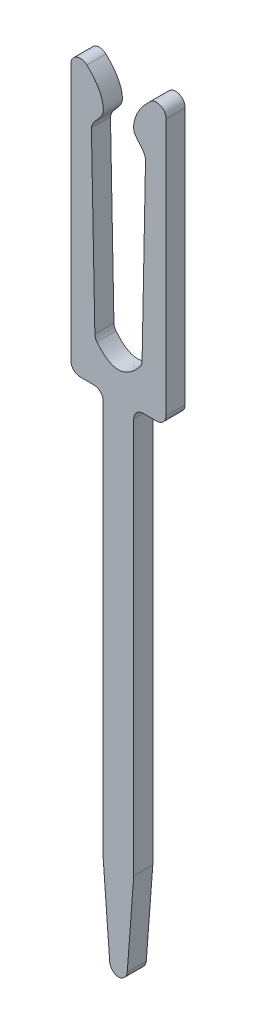
ISO-10303-21;
HEADER;
FILE_DESCRIPTION(('STEP AP214'),'2;1');
FILE_NAME('part.step','',(''),(''),'','','');
FILE_SCHEMA(('AUTOMOTIVE_DESIGN { 1 0 10303 214 1 1 1 1 }'));
ENDSEC;
DATA;
#1=APPLICATION_CONTEXT('core data for automotive mechanical design processes');
#2=APPLICATION_PROTOCOL_DEFINITION('international standard','automotive_design',2000,#1);
#3=PRODUCT_CONTEXT('',#1,'mechanical');
#4=PRODUCT('Part','Part','',(#3));
#5=PRODUCT_RELATED_PRODUCT_CATEGORY('part','',(#4));
#6=PRODUCT_DEFINITION_FORMATION('','',#4);
#7=PRODUCT_DEFINITION_CONTEXT('part definition',#1,'design');
#8=PRODUCT_DEFINITION('design','',#6,#7);
#9=PRODUCT_DEFINITION_SHAPE('','',#8);
#10=(LENGTH_UNIT() NAMED_UNIT(*) SI_UNIT(.MILLI.,.METRE.));
#11=(NAMED_UNIT(*) PLANE_ANGLE_UNIT() SI_UNIT($,.RADIAN.));
#12=(NAMED_UNIT(*) SI_UNIT($,.STERADIAN.) SOLID_ANGLE_UNIT());
#13=UNCERTAINTY_MEASURE_WITH_UNIT(LENGTH_MEASURE(1.E-05),#10,'distance_accuracy_value','');
#14=(GEOMETRIC_REPRESENTATION_CONTEXT(3) GLOBAL_UNCERTAINTY_ASSIGNED_CONTEXT((#13)) GLOBAL_UNIT_ASSIGNED_CONTEXT((#10,
#11,#12)) REPRESENTATION_CONTEXT('',''));
#15=CARTESIAN_POINT('',(0.,0.,0.));
#16=DIRECTION('',(0.,0.,1.));
#17=DIRECTION('',(1.,0.,0.));
#18=AXIS2_PLACEMENT_3D('',#15,#16,#17);
#19=CARTESIAN_POINT('',(0.0155617112013381,0.199393663752104,-0.2));
#20=DIRECTION('',(0.,0.,1.));
#21=DIRECTION('',(1.,0.,0.));
#22=AXIS2_PLACEMENT_3D('',#19,#20,#21);
#23=CYLINDRICAL_SURFACE('',#22,0.200000000000002);
#24=CARTESIAN_POINT('',(0.0155617112013381,0.199393663752104,0.2));
#25=DIRECTION('',(0.,0.,1.));
#26=DIRECTION('',(-1.,0.,0.));
#27=AXIS2_PLACEMENT_3D('',#24,#25,#26);
#28=CIRCLE('',#27,0.200000000000002);
#29=CARTESIAN_POINT('',(-0.183878150776376,0.184435674104075,0.2));
#30=VERTEX_POINT('',#29);
#31=CARTESIAN_POINT('',(0.,0.,0.2));
#32=VERTEX_POINT('',#31);
#33=EDGE_CURVE('E221',#30,#32,#28,.T.);
#34=ORIENTED_EDGE('',*,*,#33,.F.);
#35=DIRECTION('',(0.,0.,1.));
#36=VECTOR('',#35,1.);
#37=CARTESIAN_POINT('',(-0.183878150776376,0.184435674104075,-0.2));
#38=LINE('',#37,#36);
#39=CARTESIAN_POINT('',(-0.183878150776376,0.184435674104075,-0.2));
#40=VERTEX_POINT('',#39);
#41=EDGE_CURVE('E11',#40,#30,#38,.T.);
#42=ORIENTED_EDGE('',*,*,#41,.F.);
#43=CARTESIAN_POINT('',(0.0155617112013381,0.199393663752104,-0.2));
#44=DIRECTION('',(0.,0.,1.));
#45=DIRECTION('',(-1.,0.,0.));
#46=AXIS2_PLACEMENT_3D('',#43,#44,#45);
#47=CIRCLE('',#46,0.200000000000002);
#48=CARTESIAN_POINT('',(0.,0.,-0.2));
#49=VERTEX_POINT('',#48);
#50=EDGE_CURVE('E301',#40,#49,#47,.T.);
#51=ORIENTED_EDGE('',*,*,#50,.T.);
#52=DIRECTION('',(0.,0.,1.));
#53=VECTOR('',#52,1.);
#54=CARTESIAN_POINT('',(0.,0.,-0.2));
#55=LINE('',#54,#53);
#56=EDGE_CURVE('E37',#49,#32,#55,.T.);
#57=ORIENTED_EDGE('',*,*,#56,.T.);
#58=EDGE_LOOP('',(#34,#42,#51,#57));
#59=FACE_BOUND('',#58,.T.);
#60=ADVANCED_FACE('F34',(#59),#23,.T.);
#61=CARTESIAN_POINT('',(-0.183878150776376,0.184435674104075,-0.2));
#62=DIRECTION('',(-0.997199309888568,-0.0747899482401498,0.));
#63=DIRECTION('',(0.0747899482401498,-0.997199309888568,0.));
#64=AXIS2_PLACEMENT_3D('',#61,#62,#63);
#65=PLANE('',#64);
#66=DIRECTION('',(0.0747899482401498,-0.997199309888568,0.));
#67=VECTOR('',#66,1.);
#68=CARTESIAN_POINT('',(-0.183878150776376,0.184435674104075,0.2));
#69=LINE('',#68,#67);
#70=CARTESIAN_POINT('',(-0.319999999997295,1.99939366375255,0.2));
#71=VERTEX_POINT('',#70);
#72=EDGE_CURVE('E299',#71,#30,#69,.T.);
#73=ORIENTED_EDGE('',*,*,#72,.F.);
#74=DIRECTION('',(0.,0.,1.));
#75=VECTOR('',#74,1.);
#76=CARTESIAN_POINT('',(-0.319999999997295,1.99939366375255,-0.2));
#77=LINE('',#76,#75);
#78=CARTESIAN_POINT('',(-0.319999999997295,1.99939366375255,-0.2));
#79=VERTEX_POINT('',#78);
#80=EDGE_CURVE('E43',#79,#71,#77,.T.);
#81=ORIENTED_EDGE('',*,*,#80,.F.);
#82=DIRECTION('',(0.0747899482401498,-0.997199309888568,0.));
#83=VECTOR('',#82,1.);
#84=CARTESIAN_POINT('',(-0.183878150776376,0.184435674104075,-0.2));
#85=LINE('',#84,#83);
#86=EDGE_CURVE('E211',#79,#40,#85,.T.);
#87=ORIENTED_EDGE('',*,*,#86,.T.);
#88=ORIENTED_EDGE('',*,*,#41,.T.);
#89=EDGE_LOOP('',(#73,#81,#87,#88));
#90=FACE_BOUND('',#89,.T.);
#91=ADVANCED_FACE('F343',(#90),#65,.T.);
#92=CARTESIAN_POINT('',(-0.319999999997295,1.99939366375255,-0.2));
#93=DIRECTION('',(-1.,0.,0.));
#94=DIRECTION('',(0.,0.,1.));
#95=AXIS2_PLACEMENT_3D('',#92,#93,#94);
#96=PLANE('',#95);
#97=DIRECTION('',(0.,-1.,0.));
#98=VECTOR('',#97,1.);
#99=CARTESIAN_POINT('',(-0.319999999997295,1.99939366375255,0.2));
#100=LINE('',#99,#98);
#101=CARTESIAN_POINT('',(-0.319999999997295,10.2993936637524,0.2));
#102=VERTEX_POINT('',#101);
#103=EDGE_CURVE('E198',#102,#71,#100,.T.);
#104=ORIENTED_EDGE('',*,*,#103,.F.);
#105=DIRECTION('',(0.,0.,1.));
#106=VECTOR('',#105,1.);
#107=CARTESIAN_POINT('',(-0.319999999997295,10.2993936637524,-0.2));
#108=LINE('',#107,#106);
#109=CARTESIAN_POINT('',(-0.319999999997295,10.2993936637524,-0.2));
#110=VERTEX_POINT('',#109);
#111=EDGE_CURVE('E193',#110,#102,#108,.T.);
#112=ORIENTED_EDGE('',*,*,#111,.F.);
#113=DIRECTION('',(0.,-1.,0.));
#114=VECTOR('',#113,1.);
#115=CARTESIAN_POINT('',(-0.319999999997295,1.99939366375255,-0.2));
#116=LINE('',#115,#114);
#117=EDGE_CURVE('E196',#110,#79,#116,.T.);
#118=ORIENTED_EDGE('',*,*,#117,.T.);
#119=ORIENTED_EDGE('',*,*,#80,.T.);
#120=EDGE_LOOP('',(#104,#112,#118,#119));
#121=FACE_BOUND('',#120,.T.);
#122=ADVANCED_FACE('F195',(#121),#96,.T.);
#123=CARTESIAN_POINT('',(-0.519999999997294,10.2993936637524,-0.2));
#124=DIRECTION('',(0.,0.,1.));
#125=DIRECTION('',(1.,0.,0.));
#126=AXIS2_PLACEMENT_3D('',#123,#124,#125);
#127=CYLINDRICAL_SURFACE('',#126,0.200000000000002);
#128=CARTESIAN_POINT('',(-0.519999999997294,10.2993936637524,0.2));
#129=DIRECTION('',(0.,0.,-1.));
#130=DIRECTION('',(1.,0.,0.));
#131=AXIS2_PLACEMENT_3D('',#128,#129,#130);
#132=CIRCLE('',#131,0.200000000000002);
#133=CARTESIAN_POINT('',(-0.519999999997294,10.4993936637524,0.2));
#134=VERTEX_POINT('',#133);
#135=EDGE_CURVE('E296',#134,#102,#132,.T.);
#136=ORIENTED_EDGE('',*,*,#135,.F.);
#137=DIRECTION('',(0.,0.,1.));
#138=VECTOR('',#137,1.);
#139=CARTESIAN_POINT('',(-0.519999999997294,10.4993936637524,-0.2));
#140=LINE('',#139,#138);
#141=CARTESIAN_POINT('',(-0.519999999997294,10.4993936637524,-0.2));
#142=VERTEX_POINT('',#141);
#143=EDGE_CURVE('E203',#142,#134,#140,.T.);
#144=ORIENTED_EDGE('',*,*,#143,.F.);
#145=CARTESIAN_POINT('',(-0.519999999997294,10.2993936637524,-0.2));
#146=DIRECTION('',(0.,0.,-1.));
#147=DIRECTION('',(1.,0.,0.));
#148=AXIS2_PLACEMENT_3D('',#145,#146,#147);
#149=CIRCLE('',#148,0.200000000000002);
#150=EDGE_CURVE('E209',#142,#110,#149,.T.);
#151=ORIENTED_EDGE('',*,*,#150,.T.);
#152=ORIENTED_EDGE('',*,*,#111,.T.);
#153=EDGE_LOOP('',(#136,#144,#151,#152));
#154=FACE_BOUND('',#153,.T.);
#155=ADVANCED_FACE('F213',(#154),#127,.F.);
#156=CARTESIAN_POINT('',(-0.519999999997294,10.4993936637524,-0.2));
#157=DIRECTION('',(0.,-1.,0.));
#158=DIRECTION('',(0.,0.,-1.));
#159=AXIS2_PLACEMENT_3D('',#156,#157,#158);
#160=PLANE('',#159);
#161=DIRECTION('',(1.,0.,0.));
#162=VECTOR('',#161,1.);
#163=CARTESIAN_POINT('',(-0.519999999997294,10.4993936637524,0.2));
#164=LINE('',#163,#162);
#165=CARTESIAN_POINT('',(-0.799999999997296,10.4993936637524,0.2));
#166=VERTEX_POINT('',#165);
#167=EDGE_CURVE('E293',#166,#134,#164,.T.);
#168=ORIENTED_EDGE('',*,*,#167,.F.);
#169=DIRECTION('',(0.,0.,1.));
#170=VECTOR('',#169,1.);
#171=CARTESIAN_POINT('',(-0.799999999997296,10.4993936637524,-0.2));
#172=LINE('',#171,#170);
#173=CARTESIAN_POINT('',(-0.799999999997296,10.4993936637524,-0.2));
#174=VERTEX_POINT('',#173);
#175=EDGE_CURVE('E305',#174,#166,#172,.T.);
#176=ORIENTED_EDGE('',*,*,#175,.F.);
#177=DIRECTION('',(1.,0.,0.));
#178=VECTOR('',#177,1.);
#179=CARTESIAN_POINT('',(-0.519999999997294,10.4993936637524,-0.2));
#180=LINE('',#179,#178);
#181=EDGE_CURVE('E214',#174,#142,#180,.T.);
#182=ORIENTED_EDGE('',*,*,#181,.T.);
#183=ORIENTED_EDGE('',*,*,#143,.T.);
#184=EDGE_LOOP('',(#168,#176,#182,#183));
#185=FACE_BOUND('',#184,.T.);
#186=ADVANCED_FACE('F356',(#185),#160,.T.);
#187=CARTESIAN_POINT('',(-0.799999999997296,10.6993936637524,-0.2));
#188=DIRECTION('',(0.,0.,1.));
#189=DIRECTION('',(1.,0.,0.));
#190=AXIS2_PLACEMENT_3D('',#187,#188,#189);
#191=CYLINDRICAL_SURFACE('',#190,0.199999999999994);
#192=CARTESIAN_POINT('',(-0.799999999997296,10.6993936637524,0.2));
#193=DIRECTION('',(0.,0.,1.));
#194=DIRECTION('',(-1.,0.,0.));
#195=AXIS2_PLACEMENT_3D('',#192,#193,#194);
#196=CIRCLE('',#195,0.199999999999994);
#197=CARTESIAN_POINT('',(-0.99999999999729,10.6993936637524,0.2));
#198=VERTEX_POINT('',#197);
#199=EDGE_CURVE('E290',#198,#166,#196,.T.);
#200=ORIENTED_EDGE('',*,*,#199,.F.);
#201=DIRECTION('',(0.,0.,1.));
#202=VECTOR('',#201,1.);
#203=CARTESIAN_POINT('',(-0.99999999999729,10.6993936637524,-0.2));
#204=LINE('',#203,#202);
#205=CARTESIAN_POINT('',(-0.99999999999729,10.6993936637524,-0.2));
#206=VERTEX_POINT('',#205);
#207=EDGE_CURVE('E307',#206,#198,#204,.T.);
#208=ORIENTED_EDGE('',*,*,#207,.F.);
#209=CARTESIAN_POINT('',(-0.799999999997296,10.6993936637524,-0.2));
#210=DIRECTION('',(0.,0.,1.));
#211=DIRECTION('',(-1.,0.,0.));
#212=AXIS2_PLACEMENT_3D('',#209,#210,#211);
#213=CIRCLE('',#212,0.199999999999994);
#214=EDGE_CURVE('E216',#206,#174,#213,.T.);
#215=ORIENTED_EDGE('',*,*,#214,.T.);
#216=ORIENTED_EDGE('',*,*,#175,.T.);
#217=EDGE_LOOP('',(#200,#208,#215,#216));
#218=FACE_BOUND('',#217,.T.);
#219=ADVANCED_FACE('F359',(#218),#191,.T.);
#220=CARTESIAN_POINT('',(-0.999999999997291,10.6993936637524,-0.2));
#221=DIRECTION('',(-1.,0.,0.));
#222=DIRECTION('',(0.,0.,1.));
#223=AXIS2_PLACEMENT_3D('',#220,#221,#222);
#224=PLANE('',#223);
#225=DIRECTION('',(0.,-1.,0.));
#226=VECTOR('',#225,1.);
#227=CARTESIAN_POINT('',(-0.999999999997291,10.6993936637524,0.2));
#228=LINE('',#227,#226);
#229=CARTESIAN_POINT('',(-0.999999999997291,16.0898172007233,0.2));
#230=VERTEX_POINT('',#229);
#231=EDGE_CURVE('E287',#230,#198,#228,.T.);
#232=ORIENTED_EDGE('',*,*,#231,.F.);
#233=DIRECTION('',(0.,0.,1.));
#234=VECTOR('',#233,1.);
#235=CARTESIAN_POINT('',(-0.999999999997291,16.0898172007233,-0.2));
#236=LINE('',#235,#234);
#237=CARTESIAN_POINT('',(-0.999999999997291,16.0898172007233,-0.2));
#238=VERTEX_POINT('',#237);
#239=EDGE_CURVE('E309',#238,#230,#236,.T.);
#240=ORIENTED_EDGE('',*,*,#239,.F.);
#241=DIRECTION('',(0.,-1.,0.));
#242=VECTOR('',#241,1.);
#243=CARTESIAN_POINT('',(-0.999999999997291,10.6993936637524,-0.2));
#244=LINE('',#243,#242);
#245=EDGE_CURVE('E394',#238,#206,#244,.T.);
#246=ORIENTED_EDGE('',*,*,#245,.T.);
#247=ORIENTED_EDGE('',*,*,#207,.T.);
#248=EDGE_LOOP('',(#232,#240,#246,#247));
#249=FACE_BOUND('',#248,.T.);
#250=ADVANCED_FACE('F363',(#249),#224,.T.);
#251=CARTESIAN_POINT('',(-0.79999999999731,16.0898172007233,-0.2));
#252=DIRECTION('',(0.,0.,1.));
#253=DIRECTION('',(1.,0.,0.));
#254=AXIS2_PLACEMENT_3D('',#251,#252,#253);
#255=CYLINDRICAL_SURFACE('',#254,0.199999999999984);
#256=CARTESIAN_POINT('',(-0.79999999999731,16.0898172007233,0.2));
#257=DIRECTION('',(0.,0.,1.));
#258=DIRECTION('',(-1.,0.,0.));
#259=AXIS2_PLACEMENT_3D('',#256,#257,#258);
#260=CIRCLE('',#259,0.199999999999984);
#261=CARTESIAN_POINT('',(-0.663039519004157,16.2355629610256,0.2));
#262=VERTEX_POINT('',#261);
#263=EDGE_CURVE('E281',#262,#230,#260,.T.);
#264=ORIENTED_EDGE('',*,*,#263,.F.);
#265=DIRECTION('',(0.,0.,1.));
#266=VECTOR('',#265,1.);
#267=CARTESIAN_POINT('',(-0.663039519004157,16.2355629610256,-0.2));
#268=LINE('',#267,#266);
#269=CARTESIAN_POINT('',(-0.663039519004157,16.2355629610256,-0.2));
#270=VERTEX_POINT('',#269);
#271=EDGE_CURVE('E311',#270,#262,#268,.T.);
#272=ORIENTED_EDGE('',*,*,#271,.F.);
#273=CARTESIAN_POINT('',(-0.79999999999731,16.0898172007233,-0.2));
#274=DIRECTION('',(0.,0.,1.));
#275=DIRECTION('',(-1.,0.,0.));
#276=AXIS2_PLACEMENT_3D('',#273,#274,#275);
#277=CIRCLE('',#276,0.199999999999984);
#278=EDGE_CURVE('E386',#270,#238,#277,.T.);
#279=ORIENTED_EDGE('',*,*,#278,.T.);
#280=ORIENTED_EDGE('',*,*,#239,.T.);
#281=EDGE_LOOP('',(#264,#272,#279,#280));
#282=FACE_BOUND('',#281,.T.);
#283=ADVANCED_FACE('F367',(#282),#255,.T.);
#284=CARTESIAN_POINT('',(-0.56766920776094,15.140963485223,-0.2));
#285=CARTESIAN_POINT('',(-0.548453887567073,15.3086032116477,-0.2));
#286=CARTESIAN_POINT('',(-0.310671132237601,15.4208659051206,-0.2));
#287=CARTESIAN_POINT('',(-0.326177603553836,15.8487735548217,-0.2));
#288=CARTESIAN_POINT('',(-0.487599251445745,16.0706979015952,-0.2));
#289=CARTESIAN_POINT('',(-0.663039519009528,16.2355629610257,-0.2));
#290=B_SPLINE_CURVE_WITH_KNOTS('',3,(#284,#285,#286,#287,#288,#289),.UNSPECIFIED.,.F.,.F.,(4,1,
1,4),(0.253308427317744,0.546240991694777,0.590136450844154,1.),.UNSPECIFIED.);
#291=DIRECTION('',(0.,0.,1.));
#292=VECTOR('',#291,1.);
#293=SURFACE_OF_LINEAR_EXTRUSION('',#290,#292);
#294=CARTESIAN_POINT('',(-0.56766920776094,15.140963485223,0.2));
#295=CARTESIAN_POINT('',(-0.548453887567073,15.3086032116477,0.2));
#296=CARTESIAN_POINT('',(-0.310671132237601,15.4208659051206,0.2));
#297=CARTESIAN_POINT('',(-0.326177603553836,15.8487735548217,0.2));
#298=CARTESIAN_POINT('',(-0.487599251445745,16.0706979015952,0.2));
#299=CARTESIAN_POINT('',(-0.663039519009528,16.2355629610257,0.2));
#300=B_SPLINE_CURVE_WITH_KNOTS('',3,(#294,#295,#296,#297,#298,#299),.UNSPECIFIED.,.F.,.F.,(4,1,
1,4),(0.253308427317744,0.546240991694777,0.590136450844154,1.),.UNSPECIFIED.);
#301=CARTESIAN_POINT('',(-0.56766920776094,15.140963485223,0.2));
#302=VERTEX_POINT('',#301);
#303=EDGE_CURVE('E276',#302,#262,#300,.T.);
#304=ORIENTED_EDGE('',*,*,#303,.F.);
#305=DIRECTION('',(0.,0.,1.));
#306=VECTOR('',#305,1.);
#307=CARTESIAN_POINT('',(-0.56766920776094,15.140963485223,-0.2));
#308=LINE('',#307,#306);
#309=CARTESIAN_POINT('',(-0.56766920776094,15.140963485223,-0.2));
#310=VERTEX_POINT('',#309);
#311=EDGE_CURVE('E313',#310,#302,#308,.T.);
#312=ORIENTED_EDGE('',*,*,#311,.F.);
#313=EDGE_CURVE('E379',#310,#270,#290,.T.);
#314=ORIENTED_EDGE('',*,*,#313,.T.);
#315=ORIENTED_EDGE('',*,*,#271,.T.);
#316=EDGE_LOOP('',(#304,#312,#314,#315));
#317=FACE_BOUND('',#316,.T.);
#318=ADVANCED_FACE('F371',(#317),#293,.T.);
#319=CARTESIAN_POINT('',(-0.567669207755583,15.140963485223,-0.2));
#320=DIRECTION('',(0.999809016262246,0.0195430550508509,0.));
#321=DIRECTION('',(-0.0195430550508509,0.999809016262246,0.));
#322=AXIS2_PLACEMENT_3D('',#319,#320,#321);
#323=PLANE('',#322);
#324=DIRECTION('',(-0.0195430550508509,0.999809016262246,0.));
#325=VECTOR('',#324,1.);
#326=CARTESIAN_POINT('',(-0.567669207755583,15.140963485223,0.2));
#327=LINE('',#326,#325);
#328=CARTESIAN_POINT('',(-0.495215905001463,11.4343032336369,0.2));
#329=VERTEX_POINT('',#328);
#330=EDGE_CURVE('E273',#329,#302,#327,.T.);
#331=ORIENTED_EDGE('',*,*,#330,.F.);
#332=DIRECTION('',(0.,0.,1.));
#333=VECTOR('',#332,1.);
#334=CARTESIAN_POINT('',(-0.495215905001463,11.4343032336369,-0.2));
#335=LINE('',#334,#333);
#336=CARTESIAN_POINT('',(-0.495215905001463,11.4343032336369,-0.2));
#337=VERTEX_POINT('',#336);
#338=EDGE_CURVE('E315',#337,#329,#335,.T.);
#339=ORIENTED_EDGE('',*,*,#338,.F.);
#340=DIRECTION('',(-0.0195430550508509,0.999809016262246,0.));
#341=VECTOR('',#340,1.);
#342=CARTESIAN_POINT('',(-0.567669207755583,15.140963485223,-0.2));
#343=LINE('',#342,#341);
#344=EDGE_CURVE('E387',#337,#310,#343,.T.);
#345=ORIENTED_EDGE('',*,*,#344,.T.);
#346=ORIENTED_EDGE('',*,*,#311,.T.);
#347=EDGE_LOOP('',(#331,#339,#345,#346));
#348=FACE_BOUND('',#347,.T.);
#349=ADVANCED_FACE('F376',(#348),#323,.T.);
#350=CARTESIAN_POINT('',(-0.295254101749007,11.4382118446471,-0.2));
#351=DIRECTION('',(0.,0.,1.));
#352=DIRECTION('',(1.,0.,0.));
#353=AXIS2_PLACEMENT_3D('',#350,#351,#352);
#354=CYLINDRICAL_SURFACE('',#353,0.200000000000005);
#355=CARTESIAN_POINT('',(-0.295254101749007,11.4382118446471,0.2));
#356=DIRECTION('',(0.,0.,-1.));
#357=DIRECTION('',(1.,0.,0.));
#358=AXIS2_PLACEMENT_3D('',#355,#356,#357);
#359=CIRCLE('',#358,0.200000000000005);
#360=CARTESIAN_POINT('',(-0.45105383851106,11.3128067330093,0.2));
#361=VERTEX_POINT('',#360);
#362=EDGE_CURVE('E267',#361,#329,#359,.T.);
#363=ORIENTED_EDGE('',*,*,#362,.F.);
#364=DIRECTION('',(0.,0.,1.));
#365=VECTOR('',#364,1.);
#366=CARTESIAN_POINT('',(-0.45105383851106,11.3128067330093,-0.2));
#367=LINE('',#366,#365);
#368=CARTESIAN_POINT('',(-0.45105383851106,11.3128067330093,-0.2));
#369=VERTEX_POINT('',#368);
#370=EDGE_CURVE('E317',#369,#361,#367,.T.);
#371=ORIENTED_EDGE('',*,*,#370,.F.);
#372=CARTESIAN_POINT('',(-0.295254101749007,11.4382118446471,-0.2));
#373=DIRECTION('',(0.,0.,-1.));
#374=DIRECTION('',(1.,0.,0.));
#375=AXIS2_PLACEMENT_3D('',#372,#373,#374);
#376=CIRCLE('',#375,0.200000000000005);
#377=EDGE_CURVE('E412',#369,#337,#376,.T.);
#378=ORIENTED_EDGE('',*,*,#377,.T.);
#379=ORIENTED_EDGE('',*,*,#338,.T.);
#380=EDGE_LOOP('',(#363,#371,#378,#379));
#381=FACE_BOUND('',#380,.T.);
#382=ADVANCED_FACE('F431',(#381),#354,.F.);
#383=CARTESIAN_POINT('',(0.451053838511066,11.3128067330093,-0.2));
#384=CARTESIAN_POINT('',(0.,10.7524302986856,-0.2));
#385=CARTESIAN_POINT('',(-0.451053838511059,11.3128067330093,-0.2));
#386=B_SPLINE_CURVE_WITH_KNOTS('',2,(#383,#384,#385),.UNSPECIFIED.,.F.,.F.,(3,3),
(0.0434047342329982,0.956595265767001),.UNSPECIFIED.);
#387=DIRECTION('',(0.,0.,1.));
#388=VECTOR('',#387,1.);
#389=SURFACE_OF_LINEAR_EXTRUSION('',#386,#388);
#390=CARTESIAN_POINT('',(0.451053838511066,11.3128067330093,0.2));
#391=CARTESIAN_POINT('',(0.,10.7524302986856,0.2));
#392=CARTESIAN_POINT('',(-0.451053838511059,11.3128067330093,0.2));
#393=B_SPLINE_CURVE_WITH_KNOTS('',2,(#390,#391,#392),.UNSPECIFIED.,.F.,.F.,(3,3),
(0.0434047342329982,0.956595265767001),.UNSPECIFIED.);
#394=CARTESIAN_POINT('',(0.451053838511066,11.3128067330093,0.2));
#395=VERTEX_POINT('',#394);
#396=EDGE_CURVE('E262',#395,#361,#393,.T.);
#397=ORIENTED_EDGE('',*,*,#396,.F.);
#398=DIRECTION('',(0.,0.,1.));
#399=VECTOR('',#398,1.);
#400=CARTESIAN_POINT('',(0.451053838511066,11.3128067330093,-0.2));
#401=LINE('',#400,#399);
#402=CARTESIAN_POINT('',(0.451053838511066,11.3128067330093,-0.2));
#403=VERTEX_POINT('',#402);
#404=EDGE_CURVE('E319',#403,#395,#401,.T.);
#405=ORIENTED_EDGE('',*,*,#404,.F.);
#406=EDGE_CURVE('E413',#403,#369,#386,.T.);
#407=ORIENTED_EDGE('',*,*,#406,.T.);
#408=ORIENTED_EDGE('',*,*,#370,.T.);
#409=EDGE_LOOP('',(#397,#405,#407,#408));
#410=FACE_BOUND('',#409,.T.);
#411=ADVANCED_FACE('F427',(#410),#389,.T.);
#412=CARTESIAN_POINT('',(0.295254101749014,11.4382118446471,-0.2));
#413=DIRECTION('',(0.,0.,1.));
#414=DIRECTION('',(1.,0.,0.));
#415=AXIS2_PLACEMENT_3D('',#412,#413,#414);
#416=CYLINDRICAL_SURFACE('',#415,0.200000000000008);
#417=CARTESIAN_POINT('',(0.295254101749014,11.4382118446471,0.2));
#418=DIRECTION('',(0.,0.,-1.));
#419=DIRECTION('',(-1.,0.,0.));
#420=AXIS2_PLACEMENT_3D('',#417,#418,#419);
#421=CIRCLE('',#420,0.200000000000008);
#422=CARTESIAN_POINT('',(0.495215905001471,11.4343032336369,0.2));
#423=VERTEX_POINT('',#422);
#424=EDGE_CURVE('E259',#423,#395,#421,.T.);
#425=ORIENTED_EDGE('',*,*,#424,.F.);
#426=DIRECTION('',(0.,0.,1.));
#427=VECTOR('',#426,1.);
#428=CARTESIAN_POINT('',(0.495215905001471,11.4343032336369,-0.2));
#429=LINE('',#428,#427);
#430=CARTESIAN_POINT('',(0.495215905001471,11.4343032336369,-0.2));
#431=VERTEX_POINT('',#430);
#432=EDGE_CURVE('E321',#431,#423,#429,.T.);
#433=ORIENTED_EDGE('',*,*,#432,.F.);
#434=CARTESIAN_POINT('',(0.295254101749014,11.4382118446471,-0.2));
#435=DIRECTION('',(0.,0.,-1.));
#436=DIRECTION('',(-1.,0.,0.));
#437=AXIS2_PLACEMENT_3D('',#434,#435,#436);
#438=CIRCLE('',#437,0.200000000000008);
#439=EDGE_CURVE('E416',#431,#403,#438,.T.);
#440=ORIENTED_EDGE('',*,*,#439,.T.);
#441=ORIENTED_EDGE('',*,*,#404,.T.);
#442=EDGE_LOOP('',(#425,#433,#440,#441));
#443=FACE_BOUND('',#442,.T.);
#444=ADVANCED_FACE('F430',(#443),#416,.F.);
#445=CARTESIAN_POINT('',(0.56766920775559,15.140963485223,-0.2));
#446=DIRECTION('',(-0.999809016262246,0.0195430550508509,0.));
#447=DIRECTION('',(-0.0195430550508509,-0.999809016262246,0.));
#448=AXIS2_PLACEMENT_3D('',#445,#446,#447);
#449=PLANE('',#448);
#450=DIRECTION('',(-0.0195430550508509,-0.999809016262246,0.));
#451=VECTOR('',#450,1.);
#452=CARTESIAN_POINT('',(0.56766920775559,15.140963485223,0.2));
#453=LINE('',#452,#451);
#454=CARTESIAN_POINT('',(0.56766920775559,15.140963485223,0.2));
#455=VERTEX_POINT('',#454);
#456=EDGE_CURVE('E253',#455,#423,#453,.T.);
#457=ORIENTED_EDGE('',*,*,#456,.F.);
#458=DIRECTION('',(0.,0.,1.));
#459=VECTOR('',#458,1.);
#460=CARTESIAN_POINT('',(0.56766920775559,15.140963485223,-0.2));
#461=LINE('',#460,#459);
#462=CARTESIAN_POINT('',(0.56766920775559,15.140963485223,-0.2));
#463=VERTEX_POINT('',#462);
#464=EDGE_CURVE('E323',#463,#455,#461,.T.);
#465=ORIENTED_EDGE('',*,*,#464,.F.);
#466=DIRECTION('',(-0.0195430550508509,-0.999809016262246,0.));
#467=VECTOR('',#466,1.);
#468=CARTESIAN_POINT('',(0.56766920775559,15.140963485223,-0.2));
#469=LINE('',#468,#467);
#470=EDGE_CURVE('E453',#463,#431,#469,.T.);
#471=ORIENTED_EDGE('',*,*,#470,.T.);
#472=ORIENTED_EDGE('',*,*,#432,.T.);
#473=EDGE_LOOP('',(#457,#465,#471,#472));
#474=FACE_BOUND('',#473,.T.);
#475=ADVANCED_FACE('F435',(#474),#449,.T.);
#476=CARTESIAN_POINT('',(0.66303951900417,16.2355629610257,-0.2));
#477=CARTESIAN_POINT('',(0.487599251440387,16.0706979015952,-0.2));
#478=CARTESIAN_POINT('',(0.326177603548478,15.8487735548217,-0.2));
#479=CARTESIAN_POINT('',(0.310671132232245,15.4208659051206,-0.2));
#480=CARTESIAN_POINT('',(0.548453887561715,15.3086032116477,-0.2));
#481=CARTESIAN_POINT('',(0.567669207755583,15.140963485223,-0.2));
#482=B_SPLINE_CURVE_WITH_KNOTS('',3,(#476,#477,#478,#479,#480,#481),.UNSPECIFIED.,.F.,.F.,(4,1,
1,4),(0.253308427317744,0.66317197647359,0.707067435622967,1.),.UNSPECIFIED.);
#483=DIRECTION('',(0.,0.,1.));
#484=VECTOR('',#483,1.);
#485=SURFACE_OF_LINEAR_EXTRUSION('',#482,#484);
#486=CARTESIAN_POINT('',(0.66303951900417,16.2355629610257,0.2));
#487=CARTESIAN_POINT('',(0.487599251440387,16.0706979015952,0.2));
#488=CARTESIAN_POINT('',(0.326177603548478,15.8487735548217,0.2));
#489=CARTESIAN_POINT('',(0.310671132232245,15.4208659051206,0.2));
#490=CARTESIAN_POINT('',(0.548453887561715,15.3086032116477,0.2));
#491=CARTESIAN_POINT('',(0.567669207755583,15.140963485223,0.2));
#492=B_SPLINE_CURVE_WITH_KNOTS('',3,(#486,#487,#488,#489,#490,#491),.UNSPECIFIED.,.F.,.F.,(4,1,
1,4),(0.253308427317744,0.66317197647359,0.707067435622967,1.),.UNSPECIFIED.);
#493=CARTESIAN_POINT('',(0.66303951900417,16.2355629610257,0.2));
#494=VERTEX_POINT('',#493);
#495=EDGE_CURVE('E248',#494,#455,#492,.T.);
#496=ORIENTED_EDGE('',*,*,#495,.F.);
#497=DIRECTION('',(0.,0.,1.));
#498=VECTOR('',#497,1.);
#499=CARTESIAN_POINT('',(0.66303951900417,16.2355629610257,-0.2));
#500=LINE('',#499,#498);
#501=CARTESIAN_POINT('',(0.66303951900417,16.2355629610257,-0.2));
#502=VERTEX_POINT('',#501);
#503=EDGE_CURVE('E325',#502,#494,#500,.T.);
#504=ORIENTED_EDGE('',*,*,#503,.F.);
#505=EDGE_CURVE('E447',#502,#463,#482,.T.);
#506=ORIENTED_EDGE('',*,*,#505,.T.);
#507=ORIENTED_EDGE('',*,*,#464,.T.);
#508=EDGE_LOOP('',(#496,#504,#506,#507));
#509=FACE_BOUND('',#508,.T.);
#510=ADVANCED_FACE('F439',(#509),#485,.T.);
#511=CARTESIAN_POINT('',(0.799999999997317,16.0898172007233,-0.2));
#512=DIRECTION('',(0.,0.,1.));
#513=DIRECTION('',(1.,0.,0.));
#514=AXIS2_PLACEMENT_3D('',#511,#512,#513);
#515=CYLINDRICAL_SURFACE('',#514,0.199999999999992);
#516=CARTESIAN_POINT('',(0.799999999997317,16.0898172007233,0.2));
#517=DIRECTION('',(0.,0.,1.));
#518=DIRECTION('',(1.,0.,0.));
#519=AXIS2_PLACEMENT_3D('',#516,#517,#518);
#520=CIRCLE('',#519,0.199999999999992);
#521=CARTESIAN_POINT('',(0.999999999997309,16.0898172007233,0.2));
#522=VERTEX_POINT('',#521);
#523=EDGE_CURVE('E245',#522,#494,#520,.T.);
#524=ORIENTED_EDGE('',*,*,#523,.F.);
#525=DIRECTION('',(0.,0.,1.));
#526=VECTOR('',#525,1.);
#527=CARTESIAN_POINT('',(0.999999999997309,16.0898172007233,-0.2));
#528=LINE('',#527,#526);
#529=CARTESIAN_POINT('',(0.999999999997309,16.0898172007233,-0.2));
#530=VERTEX_POINT('',#529);
#531=EDGE_CURVE('E327',#530,#522,#528,.T.);
#532=ORIENTED_EDGE('',*,*,#531,.F.);
#533=CARTESIAN_POINT('',(0.799999999997317,16.0898172007233,-0.2));
#534=DIRECTION('',(0.,0.,1.));
#535=DIRECTION('',(1.,0.,0.));
#536=AXIS2_PLACEMENT_3D('',#533,#534,#535);
#537=CIRCLE('',#536,0.199999999999992);
#538=EDGE_CURVE('E454',#530,#502,#537,.T.);
#539=ORIENTED_EDGE('',*,*,#538,.T.);
#540=ORIENTED_EDGE('',*,*,#503,.T.);
#541=EDGE_LOOP('',(#524,#532,#539,#540));
#542=FACE_BOUND('',#541,.T.);
#543=ADVANCED_FACE('F444',(#542),#515,.T.);
#544=CARTESIAN_POINT('',(0.999999999997302,10.6993936637524,-0.2));
#545=DIRECTION('',(1.,0.,0.));
#546=DIRECTION('',(0.,1.,0.));
#547=AXIS2_PLACEMENT_3D('',#544,#545,#546);
#548=PLANE('',#547);
#549=DIRECTION('',(0.,1.,0.));
#550=VECTOR('',#549,1.);
#551=CARTESIAN_POINT('',(0.999999999997302,10.6993936637524,0.2));
#552=LINE('',#551,#550);
#553=CARTESIAN_POINT('',(0.999999999997302,10.6993936637524,0.2));
#554=VERTEX_POINT('',#553);
#555=EDGE_CURVE('E242',#554,#522,#552,.T.);
#556=ORIENTED_EDGE('',*,*,#555,.F.);
#557=DIRECTION('',(0.,0.,1.));
#558=VECTOR('',#557,1.);
#559=CARTESIAN_POINT('',(0.999999999997302,10.6993936637524,-0.2));
#560=LINE('',#559,#558);
#561=CARTESIAN_POINT('',(0.999999999997302,10.6993936637524,-0.2));
#562=VERTEX_POINT('',#561);
#563=EDGE_CURVE('E329',#562,#554,#560,.T.);
#564=ORIENTED_EDGE('',*,*,#563,.F.);
#565=DIRECTION('',(0.,1.,0.));
#566=VECTOR('',#565,1.);
#567=CARTESIAN_POINT('',(0.999999999997302,10.6993936637524,-0.2));
#568=LINE('',#567,#566);
#569=EDGE_CURVE('E476',#562,#530,#568,.T.);
#570=ORIENTED_EDGE('',*,*,#569,.T.);
#571=ORIENTED_EDGE('',*,*,#531,.T.);
#572=EDGE_LOOP('',(#556,#564,#570,#571));
#573=FACE_BOUND('',#572,.T.);
#574=ADVANCED_FACE('F516',(#573),#548,.T.);
#575=CARTESIAN_POINT('',(0.799999999997303,10.6993936637524,-0.2));
#576=DIRECTION('',(0.,0.,1.));
#577=DIRECTION('',(1.,0.,0.));
#578=AXIS2_PLACEMENT_3D('',#575,#576,#577);
#579=CYLINDRICAL_SURFACE('',#578,0.199999999999995);
#580=CARTESIAN_POINT('',(0.799999999997303,10.6993936637524,0.2));
#581=DIRECTION('',(0.,0.,1.));
#582=DIRECTION('',(1.,0.,0.));
#583=AXIS2_PLACEMENT_3D('',#580,#581,#582);
#584=CIRCLE('',#583,0.199999999999995);
#585=CARTESIAN_POINT('',(0.799999999997303,10.4993936637524,0.2));
#586=VERTEX_POINT('',#585);
#587=EDGE_CURVE('E239',#586,#554,#584,.T.);
#588=ORIENTED_EDGE('',*,*,#587,.F.);
#589=DIRECTION('',(0.,0.,1.));
#590=VECTOR('',#589,1.);
#591=CARTESIAN_POINT('',(0.799999999997303,10.4993936637524,-0.2));
#592=LINE('',#591,#590);
#593=CARTESIAN_POINT('',(0.799999999997303,10.4993936637524,-0.2));
#594=VERTEX_POINT('',#593);
#595=EDGE_CURVE('E331',#594,#586,#592,.T.);
#596=ORIENTED_EDGE('',*,*,#595,.F.);
#597=CARTESIAN_POINT('',(0.799999999997303,10.6993936637524,-0.2));
#598=DIRECTION('',(0.,0.,1.));
#599=DIRECTION('',(1.,0.,0.));
#600=AXIS2_PLACEMENT_3D('',#597,#598,#599);
#601=CIRCLE('',#600,0.199999999999995);
#602=EDGE_CURVE('E477',#594,#562,#601,.T.);
#603=ORIENTED_EDGE('',*,*,#602,.T.);
#604=ORIENTED_EDGE('',*,*,#563,.T.);
#605=EDGE_LOOP('',(#588,#596,#603,#604));
#606=FACE_BOUND('',#605,.T.);
#607=ADVANCED_FACE('F514',(#606),#579,.T.);
#608=CARTESIAN_POINT('',(0.519999999997294,10.4993936637524,-0.2));
#609=DIRECTION('',(0.,-1.,0.));
#610=DIRECTION('',(0.,0.,-1.));
#611=AXIS2_PLACEMENT_3D('',#608,#609,#610);
#612=PLANE('',#611);
#613=DIRECTION('',(1.,0.,0.));
#614=VECTOR('',#613,1.);
#615=CARTESIAN_POINT('',(0.519999999997294,10.4993936637524,0.2));
#616=LINE('',#615,#614);
#617=CARTESIAN_POINT('',(0.519999999997294,10.4993936637524,0.2));
#618=VERTEX_POINT('',#617);
#619=EDGE_CURVE('E236',#618,#586,#616,.T.);
#620=ORIENTED_EDGE('',*,*,#619,.F.);
#621=DIRECTION('',(0.,0.,1.));
#622=VECTOR('',#621,1.);
#623=CARTESIAN_POINT('',(0.519999999997294,10.4993936637524,-0.2));
#624=LINE('',#623,#622);
#625=CARTESIAN_POINT('',(0.519999999997294,10.4993936637524,-0.2));
#626=VERTEX_POINT('',#625);
#627=EDGE_CURVE('E333',#626,#618,#624,.T.);
#628=ORIENTED_EDGE('',*,*,#627,.F.);
#629=DIRECTION('',(1.,0.,0.));
#630=VECTOR('',#629,1.);
#631=CARTESIAN_POINT('',(0.519999999997294,10.4993936637524,-0.2));
#632=LINE('',#631,#630);
#633=EDGE_CURVE('E480',#626,#594,#632,.T.);
#634=ORIENTED_EDGE('',*,*,#633,.T.);
#635=ORIENTED_EDGE('',*,*,#595,.T.);
#636=EDGE_LOOP('',(#620,#628,#634,#635));
#637=FACE_BOUND('',#636,.T.);
#638=ADVANCED_FACE('F510',(#637),#612,.T.);
#639=CARTESIAN_POINT('',(0.519999999997294,10.2993936637524,-0.2));
#640=DIRECTION('',(0.,0.,1.));
#641=DIRECTION('',(1.,0.,0.));
#642=AXIS2_PLACEMENT_3D('',#639,#640,#641);
#643=CYLINDRICAL_SURFACE('',#642,0.200000000000002);
#644=CARTESIAN_POINT('',(0.519999999997294,10.2993936637524,0.2));
#645=DIRECTION('',(0.,0.,-1.));
#646=DIRECTION('',(-1.,0.,0.));
#647=AXIS2_PLACEMENT_3D('',#644,#645,#646);
#648=CIRCLE('',#647,0.200000000000002);
#649=CARTESIAN_POINT('',(0.319999999997291,10.2993936637524,0.2));
#650=VERTEX_POINT('',#649);
#651=EDGE_CURVE('E233',#650,#618,#648,.T.);
#652=ORIENTED_EDGE('',*,*,#651,.F.);
#653=DIRECTION('',(0.,0.,1.));
#654=VECTOR('',#653,1.);
#655=CARTESIAN_POINT('',(0.319999999997291,10.2993936637524,-0.2));
#656=LINE('',#655,#654);
#657=CARTESIAN_POINT('',(0.319999999997291,10.2993936637524,-0.2));
#658=VERTEX_POINT('',#657);
#659=EDGE_CURVE('E335',#658,#650,#656,.T.);
#660=ORIENTED_EDGE('',*,*,#659,.F.);
#661=CARTESIAN_POINT('',(0.519999999997294,10.2993936637524,-0.2));
#662=DIRECTION('',(0.,0.,-1.));
#663=DIRECTION('',(-1.,0.,0.));
#664=AXIS2_PLACEMENT_3D('',#661,#662,#663);
#665=CIRCLE('',#664,0.200000000000002);
#666=EDGE_CURVE('E485',#658,#626,#665,.T.);
#667=ORIENTED_EDGE('',*,*,#666,.T.);
#668=ORIENTED_EDGE('',*,*,#627,.T.);
#669=EDGE_LOOP('',(#652,#660,#667,#668));
#670=FACE_BOUND('',#669,.T.);
#671=ADVANCED_FACE('F506',(#670),#643,.F.);
#672=CARTESIAN_POINT('',(0.319999999997281,1.99939366375255,-0.2));
#673=DIRECTION('',(1.,0.,0.));
#674=DIRECTION('',(0.,1.,0.));
#675=AXIS2_PLACEMENT_3D('',#672,#673,#674);
#676=PLANE('',#675);
#677=DIRECTION('',(0.,1.,0.));
#678=VECTOR('',#677,1.);
#679=CARTESIAN_POINT('',(0.319999999997281,1.99939366375255,0.2));
#680=LINE('',#679,#678);
#681=CARTESIAN_POINT('',(0.319999999997281,1.99939366375255,0.2));
#682=VERTEX_POINT('',#681);
#683=EDGE_CURVE('E230',#682,#650,#680,.T.);
#684=ORIENTED_EDGE('',*,*,#683,.F.);
#685=DIRECTION('',(0.,0.,1.));
#686=VECTOR('',#685,1.);
#687=CARTESIAN_POINT('',(0.319999999997281,1.99939366375255,-0.2));
#688=LINE('',#687,#686);
#689=CARTESIAN_POINT('',(0.319999999997281,1.99939366375255,-0.2));
#690=VERTEX_POINT('',#689);
#691=EDGE_CURVE('E337',#690,#682,#688,.T.);
#692=ORIENTED_EDGE('',*,*,#691,.F.);
#693=DIRECTION('',(0.,1.,0.));
#694=VECTOR('',#693,1.);
#695=CARTESIAN_POINT('',(0.319999999997281,1.99939366375255,-0.2));
#696=LINE('',#695,#694);
#697=EDGE_CURVE('E488',#690,#658,#696,.T.);
#698=ORIENTED_EDGE('',*,*,#697,.T.);
#699=ORIENTED_EDGE('',*,*,#659,.T.);
#700=EDGE_LOOP('',(#684,#692,#698,#699));
#701=FACE_BOUND('',#700,.T.);
#702=ADVANCED_FACE('F504',(#701),#676,.T.);
#703=CARTESIAN_POINT('',(0.183878150776376,0.184435674104075,-0.2));
#704=DIRECTION('',(0.997199309888568,-0.0747899482401422,0.));
#705=DIRECTION('',(0.0747899482401422,0.997199309888568,0.));
#706=AXIS2_PLACEMENT_3D('',#703,#704,#705);
#707=PLANE('',#706);
#708=DIRECTION('',(0.0747899482401422,0.997199309888568,0.));
#709=VECTOR('',#708,1.);
#710=CARTESIAN_POINT('',(0.183878150776376,0.184435674104075,0.2));
#711=LINE('',#710,#709);
#712=CARTESIAN_POINT('',(0.183878150776376,0.184435674104075,0.2));
#713=VERTEX_POINT('',#712);
#714=EDGE_CURVE('E227',#713,#682,#711,.T.);
#715=ORIENTED_EDGE('',*,*,#714,.F.);
#716=DIRECTION('',(0.,0.,1.));
#717=VECTOR('',#716,1.);
#718=CARTESIAN_POINT('',(0.183878150776376,0.184435674104075,-0.2));
#719=LINE('',#718,#717);
#720=CARTESIAN_POINT('',(0.183878150776376,0.184435674104075,-0.2));
#721=VERTEX_POINT('',#720);
#722=EDGE_CURVE('E338',#721,#713,#719,.T.);
#723=ORIENTED_EDGE('',*,*,#722,.F.);
#724=DIRECTION('',(0.0747899482401422,0.997199309888568,0.));
#725=VECTOR('',#724,1.);
#726=CARTESIAN_POINT('',(0.183878150776376,0.184435674104075,-0.2));
#727=LINE('',#726,#725);
#728=EDGE_CURVE('E491',#721,#690,#727,.T.);
#729=ORIENTED_EDGE('',*,*,#728,.T.);
#730=ORIENTED_EDGE('',*,*,#691,.T.);
#731=EDGE_LOOP('',(#715,#723,#729,#730));
#732=FACE_BOUND('',#731,.T.);
#733=ADVANCED_FACE('F500',(#732),#707,.T.);
#734=CARTESIAN_POINT('',(-0.0155617112013381,0.199393663752104,-0.2));
#735=DIRECTION('',(0.,0.,1.));
#736=DIRECTION('',(1.,0.,0.));
#737=AXIS2_PLACEMENT_3D('',#734,#735,#736);
#738=CYLINDRICAL_SURFACE('',#737,0.200000000000002);
#739=CARTESIAN_POINT('',(-0.0155617112013381,0.199393663752104,0.2));
#740=DIRECTION('',(0.,0.,1.));
#741=DIRECTION('',(1.,0.,0.));
#742=AXIS2_PLACEMENT_3D('',#739,#740,#741);
#743=CIRCLE('',#742,0.200000000000002);
#744=EDGE_CURVE('E224',#32,#713,#743,.T.);
#745=ORIENTED_EDGE('',*,*,#744,.F.);
#746=ORIENTED_EDGE('',*,*,#56,.F.);
#747=CARTESIAN_POINT('',(-0.0155617112013381,0.199393663752104,-0.2));
#748=DIRECTION('',(0.,0.,1.));
#749=DIRECTION('',(1.,0.,0.));
#750=AXIS2_PLACEMENT_3D('',#747,#748,#749);
#751=CIRCLE('',#750,0.200000000000002);
#752=EDGE_CURVE('E494',#49,#721,#751,.T.);
#753=ORIENTED_EDGE('',*,*,#752,.T.);
#754=ORIENTED_EDGE('',*,*,#722,.T.);
#755=EDGE_LOOP('',(#745,#746,#753,#754));
#756=FACE_BOUND('',#755,.T.);
#757=ADVANCED_FACE('F340',(#756),#738,.T.);
#758=CARTESIAN_POINT('',(0.0155617112013381,0.199393663752104,-0.2));
#759=DIRECTION('',(0.,0.,-1.));
#760=DIRECTION('',(-1.,0.,0.));
#761=AXIS2_PLACEMENT_3D('',#758,#759,#760);
#762=PLANE('',#761);
#763=ORIENTED_EDGE('',*,*,#50,.F.);
#764=ORIENTED_EDGE('',*,*,#86,.F.);
#765=ORIENTED_EDGE('',*,*,#117,.F.);
#766=ORIENTED_EDGE('',*,*,#150,.F.);
#767=ORIENTED_EDGE('',*,*,#181,.F.);
#768=ORIENTED_EDGE('',*,*,#214,.F.);
#769=ORIENTED_EDGE('',*,*,#245,.F.);
#770=ORIENTED_EDGE('',*,*,#278,.F.);
#771=ORIENTED_EDGE('',*,*,#313,.F.);
#772=ORIENTED_EDGE('',*,*,#344,.F.);
#773=ORIENTED_EDGE('',*,*,#377,.F.);
#774=ORIENTED_EDGE('',*,*,#406,.F.);
#775=ORIENTED_EDGE('',*,*,#439,.F.);
#776=ORIENTED_EDGE('',*,*,#470,.F.);
#777=ORIENTED_EDGE('',*,*,#505,.F.);
#778=ORIENTED_EDGE('',*,*,#538,.F.);
#779=ORIENTED_EDGE('',*,*,#569,.F.);
#780=ORIENTED_EDGE('',*,*,#602,.F.);
#781=ORIENTED_EDGE('',*,*,#633,.F.);
#782=ORIENTED_EDGE('',*,*,#666,.F.);
#783=ORIENTED_EDGE('',*,*,#697,.F.);
#784=ORIENTED_EDGE('',*,*,#728,.F.);
#785=ORIENTED_EDGE('',*,*,#752,.F.);
#786=EDGE_LOOP('',(#763,#764,#765,#766,#767,#768,#769,#770,#771,#772,#773,#774,#775,#776,#777,
#778,#779,#780,#781,#782,#783,#784,#785));
#787=FACE_BOUND('',#786,.T.);
#788=ADVANCED_FACE('F207',(#787),#762,.T.);
#789=CARTESIAN_POINT('',(0.0155617112013381,0.199393663752104,0.2));
#790=DIRECTION('',(0.,0.,-1.));
#791=DIRECTION('',(-1.,0.,0.));
#792=AXIS2_PLACEMENT_3D('',#789,#790,#791);
#793=PLANE('',#792);
#794=ORIENTED_EDGE('',*,*,#33,.T.);
#795=ORIENTED_EDGE('',*,*,#744,.T.);
#796=ORIENTED_EDGE('',*,*,#714,.T.);
#797=ORIENTED_EDGE('',*,*,#683,.T.);
#798=ORIENTED_EDGE('',*,*,#651,.T.);
#799=ORIENTED_EDGE('',*,*,#619,.T.);
#800=ORIENTED_EDGE('',*,*,#587,.T.);
#801=ORIENTED_EDGE('',*,*,#555,.T.);
#802=ORIENTED_EDGE('',*,*,#523,.T.);
#803=ORIENTED_EDGE('',*,*,#495,.T.);
#804=ORIENTED_EDGE('',*,*,#456,.T.);
#805=ORIENTED_EDGE('',*,*,#424,.T.);
#806=ORIENTED_EDGE('',*,*,#396,.T.);
#807=ORIENTED_EDGE('',*,*,#362,.T.);
#808=ORIENTED_EDGE('',*,*,#330,.T.);
#809=ORIENTED_EDGE('',*,*,#303,.T.);
#810=ORIENTED_EDGE('',*,*,#263,.T.);
#811=ORIENTED_EDGE('',*,*,#231,.T.);
#812=ORIENTED_EDGE('',*,*,#199,.T.);
#813=ORIENTED_EDGE('',*,*,#167,.T.);
#814=ORIENTED_EDGE('',*,*,#135,.T.);
#815=ORIENTED_EDGE('',*,*,#103,.T.);
#816=ORIENTED_EDGE('',*,*,#72,.T.);
#817=EDGE_LOOP('',(#794,#795,#796,#797,#798,#799,#800,#801,#802,#803,#804,#805,#806,#807,#808,
#809,#810,#811,#812,#813,#814,#815,#816));
#818=FACE_BOUND('',#817,.T.);
#819=ADVANCED_FACE('F342',(#818),#793,.F.);
#820=CLOSED_SHELL('',(#60,#91,#122,#155,#186,#219,#250,#283,#318,#349,#382,#411,#444,#475,#510,
#543,#574,#607,#638,#671,#702,#733,#757,#788,#819));
#821=MANIFOLD_SOLID_BREP('B2',#820);
#822=ADVANCED_BREP_SHAPE_REPRESENTATION('',(#18,#821),#14);
#823=SHAPE_DEFINITION_REPRESENTATION(#9,#822);
ENDSEC;
END-ISO-10303-21;
